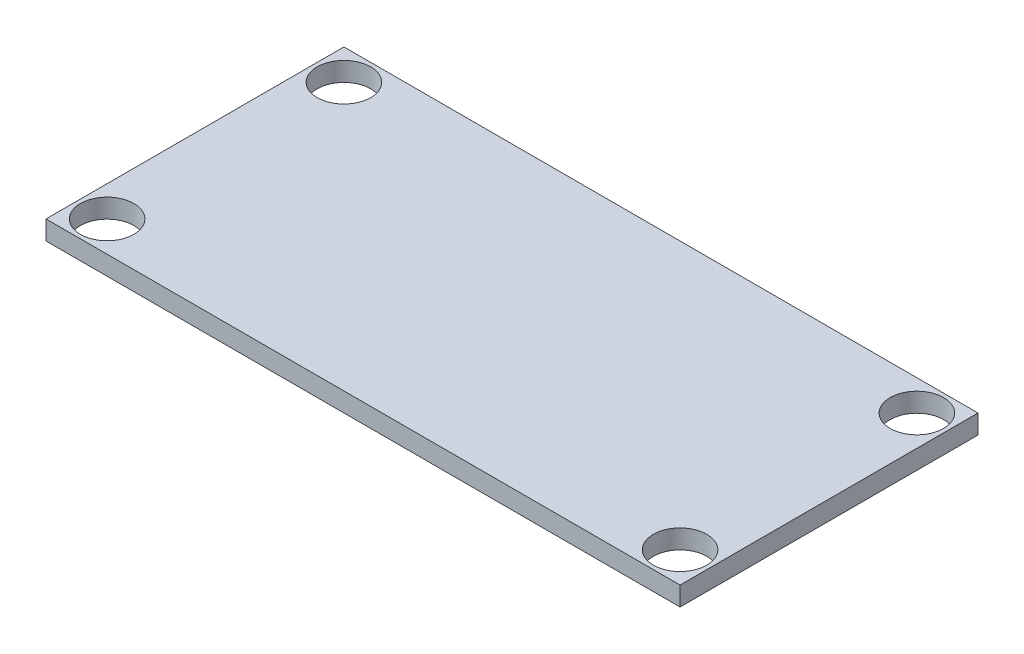
ISO-10303-21;
HEADER;
FILE_DESCRIPTION(('STEP AP214'),'2;1');
FILE_NAME('part.step','',(''),(''),'','','');
FILE_SCHEMA(('AUTOMOTIVE_DESIGN { 1 0 10303 214 1 1 1 1 }'));
ENDSEC;
DATA;
#1=APPLICATION_CONTEXT('core data for automotive mechanical design processes');
#2=APPLICATION_PROTOCOL_DEFINITION('international standard','automotive_design',2000,#1);
#3=PRODUCT_CONTEXT('',#1,'mechanical');
#4=PRODUCT('Part','Part','',(#3));
#5=PRODUCT_RELATED_PRODUCT_CATEGORY('part','',(#4));
#6=PRODUCT_DEFINITION_FORMATION('','',#4);
#7=PRODUCT_DEFINITION_CONTEXT('part definition',#1,'design');
#8=PRODUCT_DEFINITION('design','',#6,#7);
#9=PRODUCT_DEFINITION_SHAPE('','',#8);
#10=(LENGTH_UNIT() NAMED_UNIT(*) SI_UNIT(.MILLI.,.METRE.));
#11=(NAMED_UNIT(*) PLANE_ANGLE_UNIT() SI_UNIT($,.RADIAN.));
#12=(NAMED_UNIT(*) SI_UNIT($,.STERADIAN.) SOLID_ANGLE_UNIT());
#13=UNCERTAINTY_MEASURE_WITH_UNIT(LENGTH_MEASURE(1.E-05),#10,'distance_accuracy_value','');
#14=(GEOMETRIC_REPRESENTATION_CONTEXT(3) GLOBAL_UNCERTAINTY_ASSIGNED_CONTEXT((#13)) GLOBAL_UNIT_ASSIGNED_CONTEXT((#10,
#11,#12)) REPRESENTATION_CONTEXT('',''));
#15=CARTESIAN_POINT('',(0.,0.,0.));
#16=DIRECTION('',(0.,0.,1.));
#17=DIRECTION('',(1.,0.,0.));
#18=AXIS2_PLACEMENT_3D('',#15,#16,#17);
#19=CARTESIAN_POINT('',(0.,2.5,0.));
#20=DIRECTION('',(0.,-1.,0.));
#21=DIRECTION('',(0.,0.,-1.));
#22=AXIS2_PLACEMENT_3D('',#19,#20,#21);
#23=PLANE('',#22);
#24=DIRECTION('',(0.,0.,-1.));
#25=VECTOR('',#24,1.);
#26=CARTESIAN_POINT('',(41.5,2.5,19.5));
#27=LINE('',#26,#25);
#28=CARTESIAN_POINT('',(41.5,2.5,19.5));
#29=VERTEX_POINT('',#28);
#30=CARTESIAN_POINT('',(41.5,2.5,-19.5));
#31=VERTEX_POINT('',#30);
#32=EDGE_CURVE('E85',#29,#31,#27,.T.);
#33=ORIENTED_EDGE('',*,*,#32,.T.);
#34=DIRECTION('',(-1.,0.,0.));
#35=VECTOR('',#34,1.);
#36=CARTESIAN_POINT('',(-41.5,2.5,-19.5));
#37=LINE('',#36,#35);
#38=CARTESIAN_POINT('',(-41.5,2.5,-19.5));
#39=VERTEX_POINT('',#38);
#40=EDGE_CURVE('E80',#31,#39,#37,.T.);
#41=ORIENTED_EDGE('',*,*,#40,.T.);
#42=DIRECTION('',(0.,0.,1.));
#43=VECTOR('',#42,1.);
#44=CARTESIAN_POINT('',(-41.5,2.5,19.5));
#45=LINE('',#44,#43);
#46=CARTESIAN_POINT('',(-41.5,2.5,19.5));
#47=VERTEX_POINT('',#46);
#48=EDGE_CURVE('E83',#39,#47,#45,.T.);
#49=ORIENTED_EDGE('',*,*,#48,.T.);
#50=DIRECTION('',(1.,0.,0.));
#51=VECTOR('',#50,1.);
#52=CARTESIAN_POINT('',(-41.5,2.5,19.5));
#53=LINE('',#52,#51);
#54=EDGE_CURVE('E50',#47,#29,#53,.T.);
#55=ORIENTED_EDGE('',*,*,#54,.T.);
#56=EDGE_LOOP('',(#33,#41,#49,#55));
#57=FACE_BOUND('',#56,.T.);
#58=CARTESIAN_POINT('',(37.5,2.5,-15.5));
#59=DIRECTION('',(0.,1.,0.));
#60=DIRECTION('',(0.,0.,1.));
#61=AXIS2_PLACEMENT_3D('',#58,#59,#60);
#62=CIRCLE('',#61,3.5);
#63=CARTESIAN_POINT('',(37.5,2.5,-12.));
#64=VERTEX_POINT('',#63);
#65=EDGE_CURVE('E100',#64,#64,#62,.T.);
#66=ORIENTED_EDGE('',*,*,#65,.F.);
#67=EDGE_LOOP('',(#66));
#68=FACE_BOUND('',#67,.T.);
#69=CARTESIAN_POINT('',(-37.5,2.5,-15.5));
#70=DIRECTION('',(0.,1.,0.));
#71=DIRECTION('',(0.,0.,1.));
#72=AXIS2_PLACEMENT_3D('',#69,#70,#71);
#73=CIRCLE('',#72,3.5);
#74=CARTESIAN_POINT('',(-37.5,2.5,-12.));
#75=VERTEX_POINT('',#74);
#76=EDGE_CURVE('E115',#75,#75,#73,.T.);
#77=ORIENTED_EDGE('',*,*,#76,.F.);
#78=EDGE_LOOP('',(#77));
#79=FACE_BOUND('',#78,.T.);
#80=CARTESIAN_POINT('',(-37.5,2.5,15.5));
#81=DIRECTION('',(0.,1.,0.));
#82=DIRECTION('',(0.,0.,1.));
#83=AXIS2_PLACEMENT_3D('',#80,#81,#82);
#84=CIRCLE('',#83,3.5);
#85=CARTESIAN_POINT('',(-37.5,2.5,19.));
#86=VERTEX_POINT('',#85);
#87=EDGE_CURVE('E121',#86,#86,#84,.T.);
#88=ORIENTED_EDGE('',*,*,#87,.F.);
#89=EDGE_LOOP('',(#88));
#90=FACE_BOUND('',#89,.T.);
#91=CARTESIAN_POINT('',(37.5,2.5,15.5));
#92=DIRECTION('',(0.,1.,0.));
#93=DIRECTION('',(0.,0.,1.));
#94=AXIS2_PLACEMENT_3D('',#91,#92,#93);
#95=CIRCLE('',#94,3.5);
#96=CARTESIAN_POINT('',(37.5,2.5,19.));
#97=VERTEX_POINT('',#96);
#98=EDGE_CURVE('E127',#97,#97,#95,.T.);
#99=ORIENTED_EDGE('',*,*,#98,.F.);
#100=EDGE_LOOP('',(#99));
#101=FACE_BOUND('',#100,.T.);
#102=ADVANCED_FACE('F33',(#57,#68,#79,#90,#101),#23,.F.);
#103=CARTESIAN_POINT('',(0.,0.,0.));
#104=DIRECTION('',(0.,-1.,0.));
#105=DIRECTION('',(0.,0.,-1.));
#106=AXIS2_PLACEMENT_3D('',#103,#104,#105);
#107=PLANE('',#106);
#108=CARTESIAN_POINT('',(-37.5,0.,15.5));
#109=DIRECTION('',(0.,1.,0.));
#110=DIRECTION('',(0.,0.,1.));
#111=AXIS2_PLACEMENT_3D('',#108,#109,#110);
#112=CIRCLE('',#111,3.5);
#113=CARTESIAN_POINT('',(-37.5,0.,19.));
#114=VERTEX_POINT('',#113);
#115=EDGE_CURVE('E124',#114,#114,#112,.T.);
#116=ORIENTED_EDGE('',*,*,#115,.T.);
#117=EDGE_LOOP('',(#116));
#118=FACE_BOUND('',#117,.T.);
#119=CARTESIAN_POINT('',(37.5,0.,-15.5));
#120=DIRECTION('',(0.,1.,0.));
#121=DIRECTION('',(0.,0.,1.));
#122=AXIS2_PLACEMENT_3D('',#119,#120,#121);
#123=CIRCLE('',#122,3.5);
#124=CARTESIAN_POINT('',(37.5,0.,-12.));
#125=VERTEX_POINT('',#124);
#126=EDGE_CURVE('E112',#125,#125,#123,.T.);
#127=ORIENTED_EDGE('',*,*,#126,.T.);
#128=EDGE_LOOP('',(#127));
#129=FACE_BOUND('',#128,.T.);
#130=DIRECTION('',(0.,0.,-1.));
#131=VECTOR('',#130,1.);
#132=CARTESIAN_POINT('',(41.5,0.,19.5));
#133=LINE('',#132,#131);
#134=CARTESIAN_POINT('',(41.5,0.,19.5));
#135=VERTEX_POINT('',#134);
#136=CARTESIAN_POINT('',(41.5,0.,-19.5));
#137=VERTEX_POINT('',#136);
#138=EDGE_CURVE('E97',#135,#137,#133,.T.);
#139=ORIENTED_EDGE('',*,*,#138,.F.);
#140=DIRECTION('',(1.,0.,0.));
#141=VECTOR('',#140,1.);
#142=CARTESIAN_POINT('',(-41.5,0.,19.5));
#143=LINE('',#142,#141);
#144=CARTESIAN_POINT('',(-41.5,0.,19.5));
#145=VERTEX_POINT('',#144);
#146=EDGE_CURVE('E73',#145,#135,#143,.T.);
#147=ORIENTED_EDGE('',*,*,#146,.F.);
#148=DIRECTION('',(0.,0.,1.));
#149=VECTOR('',#148,1.);
#150=CARTESIAN_POINT('',(-41.5,0.,19.5));
#151=LINE('',#150,#149);
#152=CARTESIAN_POINT('',(-41.5,0.,-19.5));
#153=VERTEX_POINT('',#152);
#154=EDGE_CURVE('E67',#153,#145,#151,.T.);
#155=ORIENTED_EDGE('',*,*,#154,.F.);
#156=DIRECTION('',(-1.,0.,0.));
#157=VECTOR('',#156,1.);
#158=CARTESIAN_POINT('',(-41.5,0.,-19.5));
#159=LINE('',#158,#157);
#160=EDGE_CURVE('E89',#137,#153,#159,.T.);
#161=ORIENTED_EDGE('',*,*,#160,.F.);
#162=EDGE_LOOP('',(#139,#147,#155,#161));
#163=FACE_BOUND('',#162,.T.);
#164=CARTESIAN_POINT('',(-37.5,0.,-15.5));
#165=DIRECTION('',(0.,1.,0.));
#166=DIRECTION('',(0.,0.,1.));
#167=AXIS2_PLACEMENT_3D('',#164,#165,#166);
#168=CIRCLE('',#167,3.5);
#169=CARTESIAN_POINT('',(-37.5,0.,-12.));
#170=VERTEX_POINT('',#169);
#171=EDGE_CURVE('E118',#170,#170,#168,.T.);
#172=ORIENTED_EDGE('',*,*,#171,.T.);
#173=EDGE_LOOP('',(#172));
#174=FACE_BOUND('',#173,.T.);
#175=CARTESIAN_POINT('',(37.5,0.,15.5));
#176=DIRECTION('',(0.,1.,0.));
#177=DIRECTION('',(0.,0.,1.));
#178=AXIS2_PLACEMENT_3D('',#175,#176,#177);
#179=CIRCLE('',#178,3.5);
#180=CARTESIAN_POINT('',(37.5,0.,19.));
#181=VERTEX_POINT('',#180);
#182=EDGE_CURVE('E130',#181,#181,#179,.T.);
#183=ORIENTED_EDGE('',*,*,#182,.T.);
#184=EDGE_LOOP('',(#183));
#185=FACE_BOUND('',#184,.T.);
#186=ADVANCED_FACE('F108',(#118,#129,#163,#174,#185),#107,.T.);
#187=CARTESIAN_POINT('',(41.5,2.5,19.5));
#188=DIRECTION('',(-1.,0.,0.));
#189=DIRECTION('',(0.,0.,1.));
#190=AXIS2_PLACEMENT_3D('',#187,#188,#189);
#191=PLANE('',#190);
#192=ORIENTED_EDGE('',*,*,#138,.T.);
#193=DIRECTION('',(0.,-1.,0.));
#194=VECTOR('',#193,1.);
#195=CARTESIAN_POINT('',(41.5,2.5,-19.5));
#196=LINE('',#195,#194);
#197=EDGE_CURVE('E11',#31,#137,#196,.T.);
#198=ORIENTED_EDGE('',*,*,#197,.F.);
#199=ORIENTED_EDGE('',*,*,#32,.F.);
#200=DIRECTION('',(0.,-1.,0.));
#201=VECTOR('',#200,1.);
#202=CARTESIAN_POINT('',(41.5,2.5,19.5));
#203=LINE('',#202,#201);
#204=EDGE_CURVE('E93',#29,#135,#203,.T.);
#205=ORIENTED_EDGE('',*,*,#204,.T.);
#206=EDGE_LOOP('',(#192,#198,#199,#205));
#207=FACE_BOUND('',#206,.T.);
#208=ADVANCED_FACE('F35',(#207),#191,.F.);
#209=CARTESIAN_POINT('',(-41.5,2.5,-19.5));
#210=DIRECTION('',(0.,0.,1.));
#211=DIRECTION('',(1.,0.,0.));
#212=AXIS2_PLACEMENT_3D('',#209,#210,#211);
#213=PLANE('',#212);
#214=ORIENTED_EDGE('',*,*,#160,.T.);
#215=DIRECTION('',(0.,-1.,0.));
#216=VECTOR('',#215,1.);
#217=CARTESIAN_POINT('',(-41.5,2.5,-19.5));
#218=LINE('',#217,#216);
#219=EDGE_CURVE('E42',#39,#153,#218,.T.);
#220=ORIENTED_EDGE('',*,*,#219,.F.);
#221=ORIENTED_EDGE('',*,*,#40,.F.);
#222=ORIENTED_EDGE('',*,*,#197,.T.);
#223=EDGE_LOOP('',(#214,#220,#221,#222));
#224=FACE_BOUND('',#223,.T.);
#225=ADVANCED_FACE('F88',(#224),#213,.F.);
#226=CARTESIAN_POINT('',(-41.5,2.5,19.5));
#227=DIRECTION('',(1.,0.,0.));
#228=DIRECTION('',(0.,0.,-1.));
#229=AXIS2_PLACEMENT_3D('',#226,#227,#228);
#230=PLANE('',#229);
#231=ORIENTED_EDGE('',*,*,#154,.T.);
#232=DIRECTION('',(0.,-1.,0.));
#233=VECTOR('',#232,1.);
#234=CARTESIAN_POINT('',(-41.5,2.5,19.5));
#235=LINE('',#234,#233);
#236=EDGE_CURVE('E90',#47,#145,#235,.T.);
#237=ORIENTED_EDGE('',*,*,#236,.F.);
#238=ORIENTED_EDGE('',*,*,#48,.F.);
#239=ORIENTED_EDGE('',*,*,#219,.T.);
#240=EDGE_LOOP('',(#231,#237,#238,#239));
#241=FACE_BOUND('',#240,.T.);
#242=ADVANCED_FACE('F91',(#241),#230,.F.);
#243=CARTESIAN_POINT('',(-41.5,2.5,19.5));
#244=DIRECTION('',(0.,0.,-1.));
#245=DIRECTION('',(-1.,0.,0.));
#246=AXIS2_PLACEMENT_3D('',#243,#244,#245);
#247=PLANE('',#246);
#248=ORIENTED_EDGE('',*,*,#146,.T.);
#249=ORIENTED_EDGE('',*,*,#204,.F.);
#250=ORIENTED_EDGE('',*,*,#54,.F.);
#251=ORIENTED_EDGE('',*,*,#236,.T.);
#252=EDGE_LOOP('',(#248,#249,#250,#251));
#253=FACE_BOUND('',#252,.T.);
#254=ADVANCED_FACE('F105',(#253),#247,.F.);
#255=CARTESIAN_POINT('',(37.5,2.5,-15.5));
#256=DIRECTION('',(0.,-1.,0.));
#257=DIRECTION('',(0.,0.,-1.));
#258=AXIS2_PLACEMENT_3D('',#255,#256,#257);
#259=CYLINDRICAL_SURFACE('',#258,3.5);
#260=ORIENTED_EDGE('',*,*,#65,.T.);
#261=EDGE_LOOP('',(#260));
#262=FACE_BOUND('',#261,.T.);
#263=ORIENTED_EDGE('',*,*,#126,.F.);
#264=EDGE_LOOP('',(#263));
#265=FACE_BOUND('',#264,.T.);
#266=ADVANCED_FACE('F147',(#262,#265),#259,.F.);
#267=CARTESIAN_POINT('',(-37.5,2.5,-15.5));
#268=DIRECTION('',(0.,-1.,0.));
#269=DIRECTION('',(0.,0.,-1.));
#270=AXIS2_PLACEMENT_3D('',#267,#268,#269);
#271=CYLINDRICAL_SURFACE('',#270,3.5);
#272=ORIENTED_EDGE('',*,*,#76,.T.);
#273=EDGE_LOOP('',(#272));
#274=FACE_BOUND('',#273,.T.);
#275=ORIENTED_EDGE('',*,*,#171,.F.);
#276=EDGE_LOOP('',(#275));
#277=FACE_BOUND('',#276,.T.);
#278=ADVANCED_FACE('F193',(#274,#277),#271,.F.);
#279=CARTESIAN_POINT('',(-37.5,2.5,15.5));
#280=DIRECTION('',(0.,-1.,0.));
#281=DIRECTION('',(0.,0.,-1.));
#282=AXIS2_PLACEMENT_3D('',#279,#280,#281);
#283=CYLINDRICAL_SURFACE('',#282,3.5);
#284=ORIENTED_EDGE('',*,*,#87,.T.);
#285=EDGE_LOOP('',(#284));
#286=FACE_BOUND('',#285,.T.);
#287=ORIENTED_EDGE('',*,*,#115,.F.);
#288=EDGE_LOOP('',(#287));
#289=FACE_BOUND('',#288,.T.);
#290=ADVANCED_FACE('F201',(#286,#289),#283,.F.);
#291=CARTESIAN_POINT('',(37.5,2.5,15.5));
#292=DIRECTION('',(0.,-1.,0.));
#293=DIRECTION('',(0.,0.,-1.));
#294=AXIS2_PLACEMENT_3D('',#291,#292,#293);
#295=CYLINDRICAL_SURFACE('',#294,3.5);
#296=ORIENTED_EDGE('',*,*,#98,.T.);
#297=EDGE_LOOP('',(#296));
#298=FACE_BOUND('',#297,.T.);
#299=ORIENTED_EDGE('',*,*,#182,.F.);
#300=EDGE_LOOP('',(#299));
#301=FACE_BOUND('',#300,.T.);
#302=ADVANCED_FACE('F136',(#298,#301),#295,.F.);
#303=CLOSED_SHELL('',(#102,#186,#208,#225,#242,#254,#266,#278,#290,#302));
#304=MANIFOLD_SOLID_BREP('B2',#303);
#305=ADVANCED_BREP_SHAPE_REPRESENTATION('',(#18,#304),#14);
#306=SHAPE_DEFINITION_REPRESENTATION(#9,#305);
ENDSEC;
END-ISO-10303-21;
